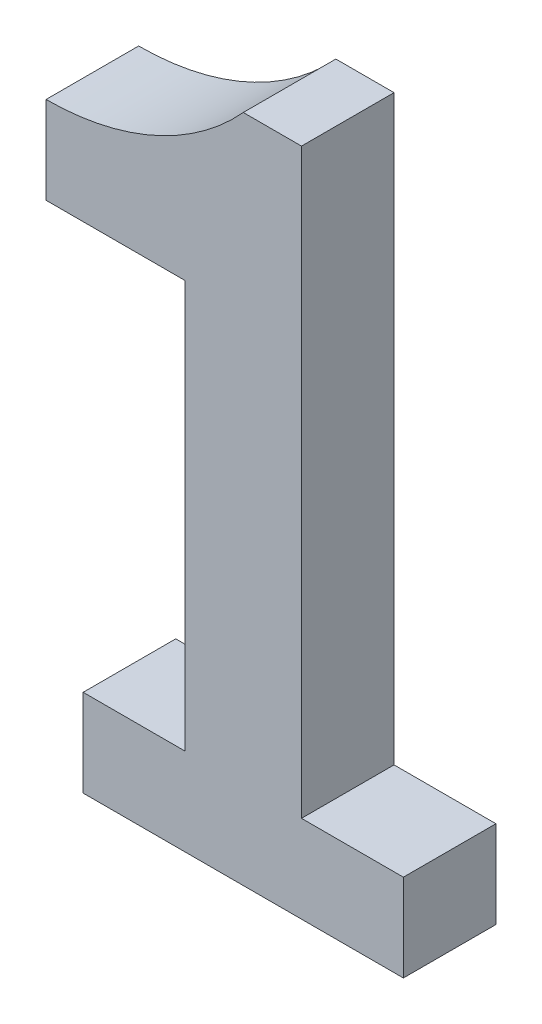
ISO-10303-21;
HEADER;
FILE_DESCRIPTION(('STEP AP214'),'2;1');
FILE_NAME('part.step','',(''),(''),'','','');
FILE_SCHEMA(('AUTOMOTIVE_DESIGN { 1 0 10303 214 1 1 1 1 }'));
ENDSEC;
DATA;
#1=APPLICATION_CONTEXT('core data for automotive mechanical design processes');
#2=APPLICATION_PROTOCOL_DEFINITION('international standard','automotive_design',2000,#1);
#3=PRODUCT_CONTEXT('',#1,'mechanical');
#4=PRODUCT('Part','Part','',(#3));
#5=PRODUCT_RELATED_PRODUCT_CATEGORY('part','',(#4));
#6=PRODUCT_DEFINITION_FORMATION('','',#4);
#7=PRODUCT_DEFINITION_CONTEXT('part definition',#1,'design');
#8=PRODUCT_DEFINITION('design','',#6,#7);
#9=PRODUCT_DEFINITION_SHAPE('','',#8);
#10=(LENGTH_UNIT() NAMED_UNIT(*) SI_UNIT(.MILLI.,.METRE.));
#11=(NAMED_UNIT(*) PLANE_ANGLE_UNIT() SI_UNIT($,.RADIAN.));
#12=(NAMED_UNIT(*) SI_UNIT($,.STERADIAN.) SOLID_ANGLE_UNIT());
#13=UNCERTAINTY_MEASURE_WITH_UNIT(LENGTH_MEASURE(1.E-05),#10,'distance_accuracy_value','');
#14=(GEOMETRIC_REPRESENTATION_CONTEXT(3) GLOBAL_UNCERTAINTY_ASSIGNED_CONTEXT((#13)) GLOBAL_UNIT_ASSIGNED_CONTEXT((#10,
#11,#12)) REPRESENTATION_CONTEXT('',''));
#15=CARTESIAN_POINT('',(0.,0.,0.));
#16=DIRECTION('',(0.,0.,1.));
#17=DIRECTION('',(1.,0.,0.));
#18=AXIS2_PLACEMENT_3D('',#15,#16,#17);
#19=CARTESIAN_POINT('',(0.,0.,0.));
#20=DIRECTION('',(0.,0.,1.));
#21=DIRECTION('',(1.,0.,0.));
#22=AXIS2_PLACEMENT_3D('',#19,#20,#21);
#23=PLANE('',#22);
#24=DIRECTION('',(-1.,0.,0.));
#25=VECTOR('',#24,1.);
#26=CARTESIAN_POINT('',(48.0536663522602,-28.0690134153364,0.));
#27=LINE('',#26,#25);
#28=CARTESIAN_POINT('',(48.0536663522602,-28.0690134153364,0.));
#29=VERTEX_POINT('',#28);
#30=CARTESIAN_POINT('',(46.0536663522602,-28.0690134153364,0.));
#31=VERTEX_POINT('',#30);
#32=EDGE_CURVE('E66',#29,#31,#27,.T.);
#33=ORIENTED_EDGE('',*,*,#32,.F.);
#34=DIRECTION('',(0.,1.,0.));
#35=VECTOR('',#34,1.);
#36=CARTESIAN_POINT('',(48.0536663522602,-28.0690134153364,0.));
#37=LINE('',#36,#35);
#38=CARTESIAN_POINT('',(48.0536663522603,-48.0690134153364,0.));
#39=VERTEX_POINT('',#38);
#40=EDGE_CURVE('E166',#39,#29,#37,.T.);
#41=ORIENTED_EDGE('',*,*,#40,.F.);
#42=DIRECTION('',(-1.,0.,0.));
#43=VECTOR('',#42,1.);
#44=CARTESIAN_POINT('',(48.0536663522603,-48.0690134153364,0.));
#45=LINE('',#44,#43);
#46=CARTESIAN_POINT('',(51.5536663522603,-48.0690134153364,0.));
#47=VERTEX_POINT('',#46);
#48=EDGE_CURVE('E163',#47,#39,#45,.T.);
#49=ORIENTED_EDGE('',*,*,#48,.F.);
#50=DIRECTION('',(0.,1.,0.));
#51=VECTOR('',#50,1.);
#52=CARTESIAN_POINT('',(51.5536663522603,-48.0690134153364,0.));
#53=LINE('',#52,#51);
#54=CARTESIAN_POINT('',(51.5536663522603,-51.0690134153364,0.));
#55=VERTEX_POINT('',#54);
#56=EDGE_CURVE('E160',#55,#47,#53,.T.);
#57=ORIENTED_EDGE('',*,*,#56,.F.);
#58=DIRECTION('',(1.,0.,0.));
#59=VECTOR('',#58,1.);
#60=CARTESIAN_POINT('',(51.5536663522603,-51.0690134153364,0.));
#61=LINE('',#60,#59);
#62=CARTESIAN_POINT('',(40.5536663522602,-51.0690134153364,0.));
#63=VERTEX_POINT('',#62);
#64=EDGE_CURVE('E157',#63,#55,#61,.T.);
#65=ORIENTED_EDGE('',*,*,#64,.F.);
#66=DIRECTION('',(0.,-1.,0.));
#67=VECTOR('',#66,1.);
#68=CARTESIAN_POINT('',(40.5536663522602,-51.0690134153364,0.));
#69=LINE('',#68,#67);
#70=CARTESIAN_POINT('',(40.5536663522602,-48.0690134153364,0.));
#71=VERTEX_POINT('',#70);
#72=EDGE_CURVE('E154',#71,#63,#69,.T.);
#73=ORIENTED_EDGE('',*,*,#72,.F.);
#74=DIRECTION('',(-1.,0.,0.));
#75=VECTOR('',#74,1.);
#76=CARTESIAN_POINT('',(40.5536663522602,-48.0690134153364,0.));
#77=LINE('',#76,#75);
#78=CARTESIAN_POINT('',(44.0536663522602,-48.0690134153364,0.));
#79=VERTEX_POINT('',#78);
#80=EDGE_CURVE('E148',#79,#71,#77,.T.);
#81=ORIENTED_EDGE('',*,*,#80,.F.);
#82=DIRECTION('',(0.,-1.,0.));
#83=VECTOR('',#82,1.);
#84=CARTESIAN_POINT('',(44.0536663522602,-48.0690134153364,0.));
#85=LINE('',#84,#83);
#86=CARTESIAN_POINT('',(44.0536663522602,-34.0690134153364,0.));
#87=VERTEX_POINT('',#86);
#88=EDGE_CURVE('E146',#87,#79,#85,.T.);
#89=ORIENTED_EDGE('',*,*,#88,.F.);
#90=DIRECTION('',(1.,0.,0.));
#91=VECTOR('',#90,1.);
#92=CARTESIAN_POINT('',(44.0536663522602,-34.0690134153364,0.));
#93=LINE('',#92,#91);
#94=CARTESIAN_POINT('',(39.2787683411179,-34.0690134153364,0.));
#95=VERTEX_POINT('',#94);
#96=EDGE_CURVE('E129',#95,#87,#93,.T.);
#97=ORIENTED_EDGE('',*,*,#96,.F.);
#98=DIRECTION('',(0.,-1.,0.));
#99=VECTOR('',#98,1.);
#100=CARTESIAN_POINT('',(39.2787683411179,-34.0690134153364,0.));
#101=LINE('',#100,#99);
#102=CARTESIAN_POINT('',(39.2787683411179,-31.0690134153364,0.));
#103=VERTEX_POINT('',#102);
#104=EDGE_CURVE('E137',#103,#95,#101,.T.);
#105=ORIENTED_EDGE('',*,*,#104,.F.);
#106=CARTESIAN_POINT('',(39.2787683411179,-21.919139571773,0.));
#107=DIRECTION('',(0.,0.,-1.));
#108=DIRECTION('',(1.,0.,0.));
#109=AXIS2_PLACEMENT_3D('',#106,#107,#108);
#110=CIRCLE('',#109,9.14987384356337);
#111=EDGE_CURVE('E142',#31,#103,#110,.T.);
#112=ORIENTED_EDGE('',*,*,#111,.F.);
#113=EDGE_LOOP('',(#33,#41,#49,#57,#65,#73,#81,#89,#97,#105,#112));
#114=FACE_BOUND('',#113,.T.);
#115=ADVANCED_FACE('F42',(#114),#23,.F.);
#116=CARTESIAN_POINT('',(48.0536663522602,-28.0690134153364,0.));
#117=DIRECTION('',(0.,1.,0.));
#118=DIRECTION('',(-1.,0.,0.));
#119=AXIS2_PLACEMENT_3D('',#116,#117,#118);
#120=PLANE('',#119);
#121=DIRECTION('',(-1.,0.,0.));
#122=VECTOR('',#121,1.);
#123=CARTESIAN_POINT('',(48.0536663522602,-28.0690134153364,3.18));
#124=LINE('',#123,#122);
#125=CARTESIAN_POINT('',(48.0536663522602,-28.0690134153364,3.18));
#126=VERTEX_POINT('',#125);
#127=CARTESIAN_POINT('',(46.0536663522602,-28.0690134153364,3.18));
#128=VERTEX_POINT('',#127);
#129=EDGE_CURVE('E169',#126,#128,#124,.T.);
#130=ORIENTED_EDGE('',*,*,#129,.F.);
#131=DIRECTION('',(0.,0.,1.));
#132=VECTOR('',#131,1.);
#133=CARTESIAN_POINT('',(48.0536663522602,-28.0690134153364,0.));
#134=LINE('',#133,#132);
#135=EDGE_CURVE('E12',#29,#126,#134,.T.);
#136=ORIENTED_EDGE('',*,*,#135,.F.);
#137=ORIENTED_EDGE('',*,*,#32,.T.);
#138=DIRECTION('',(0.,0.,1.));
#139=VECTOR('',#138,1.);
#140=CARTESIAN_POINT('',(46.0536663522602,-28.0690134153364,0.));
#141=LINE('',#140,#139);
#142=EDGE_CURVE('E45',#31,#128,#141,.T.);
#143=ORIENTED_EDGE('',*,*,#142,.T.);
#144=EDGE_LOOP('',(#130,#136,#137,#143));
#145=FACE_BOUND('',#144,.T.);
#146=ADVANCED_FACE('F212',(#145),#120,.T.);
#147=CARTESIAN_POINT('',(48.0536663522602,-28.0690134153364,0.));
#148=DIRECTION('',(1.,0.,0.));
#149=DIRECTION('',(0.,1.,0.));
#150=AXIS2_PLACEMENT_3D('',#147,#148,#149);
#151=PLANE('',#150);
#152=DIRECTION('',(0.,1.,0.));
#153=VECTOR('',#152,1.);
#154=CARTESIAN_POINT('',(48.0536663522602,-28.0690134153364,3.18));
#155=LINE('',#154,#153);
#156=CARTESIAN_POINT('',(48.0536663522603,-48.0690134153364,3.18));
#157=VERTEX_POINT('',#156);
#158=EDGE_CURVE('E195',#157,#126,#155,.T.);
#159=ORIENTED_EDGE('',*,*,#158,.F.);
#160=DIRECTION('',(0.,0.,1.));
#161=VECTOR('',#160,1.);
#162=CARTESIAN_POINT('',(48.0536663522603,-48.0690134153364,0.));
#163=LINE('',#162,#161);
#164=EDGE_CURVE('E50',#39,#157,#163,.T.);
#165=ORIENTED_EDGE('',*,*,#164,.F.);
#166=ORIENTED_EDGE('',*,*,#40,.T.);
#167=ORIENTED_EDGE('',*,*,#135,.T.);
#168=EDGE_LOOP('',(#159,#165,#166,#167));
#169=FACE_BOUND('',#168,.T.);
#170=ADVANCED_FACE('F219',(#169),#151,.T.);
#171=CARTESIAN_POINT('',(48.0536663522603,-48.0690134153364,0.));
#172=DIRECTION('',(0.,1.,0.));
#173=DIRECTION('',(0.,0.,1.));
#174=AXIS2_PLACEMENT_3D('',#171,#172,#173);
#175=PLANE('',#174);
#176=DIRECTION('',(-1.,0.,0.));
#177=VECTOR('',#176,1.);
#178=CARTESIAN_POINT('',(48.0536663522603,-48.0690134153364,3.18));
#179=LINE('',#178,#177);
#180=CARTESIAN_POINT('',(51.5536663522603,-48.0690134153364,3.18));
#181=VERTEX_POINT('',#180);
#182=EDGE_CURVE('E192',#181,#157,#179,.T.);
#183=ORIENTED_EDGE('',*,*,#182,.F.);
#184=DIRECTION('',(0.,0.,1.));
#185=VECTOR('',#184,1.);
#186=CARTESIAN_POINT('',(51.5536663522603,-48.0690134153364,0.));
#187=LINE('',#186,#185);
#188=EDGE_CURVE('E199',#47,#181,#187,.T.);
#189=ORIENTED_EDGE('',*,*,#188,.F.);
#190=ORIENTED_EDGE('',*,*,#48,.T.);
#191=ORIENTED_EDGE('',*,*,#164,.T.);
#192=EDGE_LOOP('',(#183,#189,#190,#191));
#193=FACE_BOUND('',#192,.T.);
#194=ADVANCED_FACE('F226',(#193),#175,.T.);
#195=CARTESIAN_POINT('',(51.5536663522603,-48.0690134153364,0.));
#196=DIRECTION('',(1.,0.,0.));
#197=DIRECTION('',(0.,0.,-1.));
#198=AXIS2_PLACEMENT_3D('',#195,#196,#197);
#199=PLANE('',#198);
#200=DIRECTION('',(0.,1.,0.));
#201=VECTOR('',#200,1.);
#202=CARTESIAN_POINT('',(51.5536663522603,-48.0690134153364,3.18));
#203=LINE('',#202,#201);
#204=CARTESIAN_POINT('',(51.5536663522603,-51.0690134153364,3.18));
#205=VERTEX_POINT('',#204);
#206=EDGE_CURVE('E189',#205,#181,#203,.T.);
#207=ORIENTED_EDGE('',*,*,#206,.F.);
#208=DIRECTION('',(0.,0.,1.));
#209=VECTOR('',#208,1.);
#210=CARTESIAN_POINT('',(51.5536663522603,-51.0690134153364,0.));
#211=LINE('',#210,#209);
#212=EDGE_CURVE('E201',#55,#205,#211,.T.);
#213=ORIENTED_EDGE('',*,*,#212,.F.);
#214=ORIENTED_EDGE('',*,*,#56,.T.);
#215=ORIENTED_EDGE('',*,*,#188,.T.);
#216=EDGE_LOOP('',(#207,#213,#214,#215));
#217=FACE_BOUND('',#216,.T.);
#218=ADVANCED_FACE('F229',(#217),#199,.T.);
#219=CARTESIAN_POINT('',(51.5536663522603,-51.0690134153364,0.));
#220=DIRECTION('',(0.,-1.,0.));
#221=DIRECTION('',(0.,0.,-1.));
#222=AXIS2_PLACEMENT_3D('',#219,#220,#221);
#223=PLANE('',#222);
#224=DIRECTION('',(1.,0.,0.));
#225=VECTOR('',#224,1.);
#226=CARTESIAN_POINT('',(51.5536663522603,-51.0690134153364,3.18));
#227=LINE('',#226,#225);
#228=CARTESIAN_POINT('',(40.5536663522602,-51.0690134153364,3.18));
#229=VERTEX_POINT('',#228);
#230=EDGE_CURVE('E186',#229,#205,#227,.T.);
#231=ORIENTED_EDGE('',*,*,#230,.F.);
#232=DIRECTION('',(0.,0.,1.));
#233=VECTOR('',#232,1.);
#234=CARTESIAN_POINT('',(40.5536663522602,-51.0690134153364,0.));
#235=LINE('',#234,#233);
#236=EDGE_CURVE('E203',#63,#229,#235,.T.);
#237=ORIENTED_EDGE('',*,*,#236,.F.);
#238=ORIENTED_EDGE('',*,*,#64,.T.);
#239=ORIENTED_EDGE('',*,*,#212,.T.);
#240=EDGE_LOOP('',(#231,#237,#238,#239));
#241=FACE_BOUND('',#240,.T.);
#242=ADVANCED_FACE('F232',(#241),#223,.T.);
#243=CARTESIAN_POINT('',(40.5536663522602,-51.0690134153364,0.));
#244=DIRECTION('',(-1.,0.,0.));
#245=DIRECTION('',(0.,0.,1.));
#246=AXIS2_PLACEMENT_3D('',#243,#244,#245);
#247=PLANE('',#246);
#248=DIRECTION('',(0.,-1.,0.));
#249=VECTOR('',#248,1.);
#250=CARTESIAN_POINT('',(40.5536663522602,-51.0690134153364,3.18));
#251=LINE('',#250,#249);
#252=CARTESIAN_POINT('',(40.5536663522602,-48.0690134153364,3.18));
#253=VERTEX_POINT('',#252);
#254=EDGE_CURVE('E183',#253,#229,#251,.T.);
#255=ORIENTED_EDGE('',*,*,#254,.F.);
#256=DIRECTION('',(0.,0.,1.));
#257=VECTOR('',#256,1.);
#258=CARTESIAN_POINT('',(40.5536663522602,-48.0690134153364,0.));
#259=LINE('',#258,#257);
#260=EDGE_CURVE('E205',#71,#253,#259,.T.);
#261=ORIENTED_EDGE('',*,*,#260,.F.);
#262=ORIENTED_EDGE('',*,*,#72,.T.);
#263=ORIENTED_EDGE('',*,*,#236,.T.);
#264=EDGE_LOOP('',(#255,#261,#262,#263));
#265=FACE_BOUND('',#264,.T.);
#266=ADVANCED_FACE('F236',(#265),#247,.T.);
#267=CARTESIAN_POINT('',(40.5536663522602,-48.0690134153364,0.));
#268=DIRECTION('',(0.,1.,0.));
#269=DIRECTION('',(0.,0.,1.));
#270=AXIS2_PLACEMENT_3D('',#267,#268,#269);
#271=PLANE('',#270);
#272=DIRECTION('',(-1.,0.,0.));
#273=VECTOR('',#272,1.);
#274=CARTESIAN_POINT('',(40.5536663522602,-48.0690134153364,3.18));
#275=LINE('',#274,#273);
#276=CARTESIAN_POINT('',(44.0536663522602,-48.0690134153364,3.18));
#277=VERTEX_POINT('',#276);
#278=EDGE_CURVE('E180',#277,#253,#275,.T.);
#279=ORIENTED_EDGE('',*,*,#278,.F.);
#280=DIRECTION('',(0.,0.,1.));
#281=VECTOR('',#280,1.);
#282=CARTESIAN_POINT('',(44.0536663522602,-48.0690134153364,0.));
#283=LINE('',#282,#281);
#284=EDGE_CURVE('E207',#79,#277,#283,.T.);
#285=ORIENTED_EDGE('',*,*,#284,.F.);
#286=ORIENTED_EDGE('',*,*,#80,.T.);
#287=ORIENTED_EDGE('',*,*,#260,.T.);
#288=EDGE_LOOP('',(#279,#285,#286,#287));
#289=FACE_BOUND('',#288,.T.);
#290=ADVANCED_FACE('F239',(#289),#271,.T.);
#291=CARTESIAN_POINT('',(44.0536663522602,-48.0690134153364,0.));
#292=DIRECTION('',(-1.,0.,0.));
#293=DIRECTION('',(0.,0.,1.));
#294=AXIS2_PLACEMENT_3D('',#291,#292,#293);
#295=PLANE('',#294);
#296=DIRECTION('',(0.,-1.,0.));
#297=VECTOR('',#296,1.);
#298=CARTESIAN_POINT('',(44.0536663522602,-48.0690134153364,3.18));
#299=LINE('',#298,#297);
#300=CARTESIAN_POINT('',(44.0536663522602,-34.0690134153364,3.18));
#301=VERTEX_POINT('',#300);
#302=EDGE_CURVE('E177',#301,#277,#299,.T.);
#303=ORIENTED_EDGE('',*,*,#302,.F.);
#304=DIRECTION('',(0.,0.,1.));
#305=VECTOR('',#304,1.);
#306=CARTESIAN_POINT('',(44.0536663522602,-34.0690134153364,0.));
#307=LINE('',#306,#305);
#308=EDGE_CURVE('E133',#87,#301,#307,.T.);
#309=ORIENTED_EDGE('',*,*,#308,.F.);
#310=ORIENTED_EDGE('',*,*,#88,.T.);
#311=ORIENTED_EDGE('',*,*,#284,.T.);
#312=EDGE_LOOP('',(#303,#309,#310,#311));
#313=FACE_BOUND('',#312,.T.);
#314=ADVANCED_FACE('F242',(#313),#295,.T.);
#315=CARTESIAN_POINT('',(44.0536663522602,-34.0690134153364,0.));
#316=DIRECTION('',(0.,-1.,0.));
#317=DIRECTION('',(0.,0.,-1.));
#318=AXIS2_PLACEMENT_3D('',#315,#316,#317);
#319=PLANE('',#318);
#320=DIRECTION('',(1.,0.,0.));
#321=VECTOR('',#320,1.);
#322=CARTESIAN_POINT('',(44.0536663522602,-34.0690134153364,3.18));
#323=LINE('',#322,#321);
#324=CARTESIAN_POINT('',(39.2787683411179,-34.0690134153364,3.18));
#325=VERTEX_POINT('',#324);
#326=EDGE_CURVE('E132',#325,#301,#323,.T.);
#327=ORIENTED_EDGE('',*,*,#326,.F.);
#328=DIRECTION('',(0.,0.,1.));
#329=VECTOR('',#328,1.);
#330=CARTESIAN_POINT('',(39.2787683411179,-34.0690134153364,0.));
#331=LINE('',#330,#329);
#332=EDGE_CURVE('E125',#95,#325,#331,.T.);
#333=ORIENTED_EDGE('',*,*,#332,.F.);
#334=ORIENTED_EDGE('',*,*,#96,.T.);
#335=ORIENTED_EDGE('',*,*,#308,.T.);
#336=EDGE_LOOP('',(#327,#333,#334,#335));
#337=FACE_BOUND('',#336,.T.);
#338=ADVANCED_FACE('F127',(#337),#319,.T.);
#339=CARTESIAN_POINT('',(39.2787683411179,-34.0690134153364,0.));
#340=DIRECTION('',(-1.,0.,0.));
#341=DIRECTION('',(0.,-1.,0.));
#342=AXIS2_PLACEMENT_3D('',#339,#340,#341);
#343=PLANE('',#342);
#344=DIRECTION('',(0.,-1.,0.));
#345=VECTOR('',#344,1.);
#346=CARTESIAN_POINT('',(39.2787683411179,-34.0690134153364,3.18));
#347=LINE('',#346,#345);
#348=CARTESIAN_POINT('',(39.2787683411179,-31.0690134153364,3.18));
#349=VERTEX_POINT('',#348);
#350=EDGE_CURVE('E58',#349,#325,#347,.T.);
#351=ORIENTED_EDGE('',*,*,#350,.F.);
#352=DIRECTION('',(0.,0.,1.));
#353=VECTOR('',#352,1.);
#354=CARTESIAN_POINT('',(39.2787683411179,-31.0690134153364,0.));
#355=LINE('',#354,#353);
#356=EDGE_CURVE('E134',#103,#349,#355,.T.);
#357=ORIENTED_EDGE('',*,*,#356,.F.);
#358=ORIENTED_EDGE('',*,*,#104,.T.);
#359=ORIENTED_EDGE('',*,*,#332,.T.);
#360=EDGE_LOOP('',(#351,#357,#358,#359));
#361=FACE_BOUND('',#360,.T.);
#362=ADVANCED_FACE('F138',(#361),#343,.T.);
#363=CARTESIAN_POINT('',(39.2787683411179,-21.919139571773,0.));
#364=DIRECTION('',(0.,0.,1.));
#365=DIRECTION('',(1.,0.,0.));
#366=AXIS2_PLACEMENT_3D('',#363,#364,#365);
#367=CYLINDRICAL_SURFACE('',#366,9.14987384356337);
#368=CARTESIAN_POINT('',(39.2787683411179,-21.919139571773,3.18));
#369=DIRECTION('',(0.,0.,-1.));
#370=DIRECTION('',(1.,0.,0.));
#371=AXIS2_PLACEMENT_3D('',#368,#369,#370);
#372=CIRCLE('',#371,9.14987384356337);
#373=EDGE_CURVE('E172',#128,#349,#372,.T.);
#374=ORIENTED_EDGE('',*,*,#373,.F.);
#375=ORIENTED_EDGE('',*,*,#142,.F.);
#376=ORIENTED_EDGE('',*,*,#111,.T.);
#377=ORIENTED_EDGE('',*,*,#356,.T.);
#378=EDGE_LOOP('',(#374,#375,#376,#377));
#379=FACE_BOUND('',#378,.T.);
#380=ADVANCED_FACE('F213',(#379),#367,.F.);
#381=CARTESIAN_POINT('',(0.,0.,3.18));
#382=DIRECTION('',(0.,0.,1.));
#383=DIRECTION('',(1.,0.,0.));
#384=AXIS2_PLACEMENT_3D('',#381,#382,#383);
#385=PLANE('',#384);
#386=ORIENTED_EDGE('',*,*,#158,.T.);
#387=ORIENTED_EDGE('',*,*,#129,.T.);
#388=ORIENTED_EDGE('',*,*,#373,.T.);
#389=ORIENTED_EDGE('',*,*,#350,.T.);
#390=ORIENTED_EDGE('',*,*,#326,.T.);
#391=ORIENTED_EDGE('',*,*,#302,.T.);
#392=ORIENTED_EDGE('',*,*,#278,.T.);
#393=ORIENTED_EDGE('',*,*,#254,.T.);
#394=ORIENTED_EDGE('',*,*,#230,.T.);
#395=ORIENTED_EDGE('',*,*,#206,.T.);
#396=ORIENTED_EDGE('',*,*,#182,.T.);
#397=EDGE_LOOP('',(#386,#387,#388,#389,#390,#391,#392,#393,#394,#395,#396));
#398=FACE_BOUND('',#397,.T.);
#399=ADVANCED_FACE('F215',(#398),#385,.T.);
#400=CLOSED_SHELL('',(#115,#146,#170,#194,#218,#242,#266,#290,#314,#338,#362,#380,#399));
#401=MANIFOLD_SOLID_BREP('B2',#400);
#402=ADVANCED_BREP_SHAPE_REPRESENTATION('',(#18,#401),#14);
#403=SHAPE_DEFINITION_REPRESENTATION(#9,#402);
ENDSEC;
END-ISO-10303-21;
